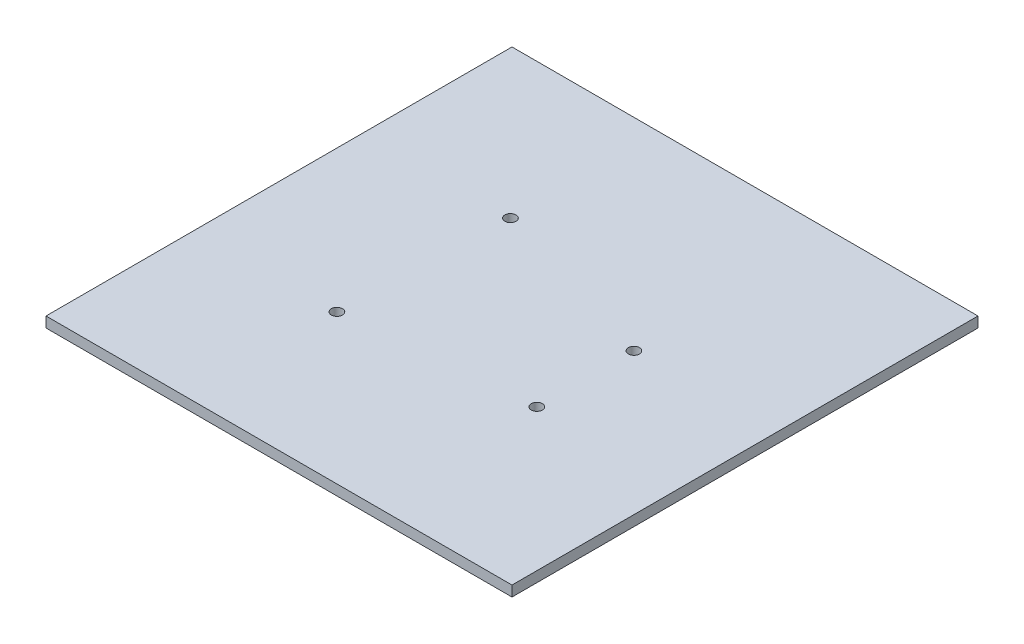
ISO-10303-21;
HEADER;
FILE_DESCRIPTION(('STEP AP214'),'2;1');
FILE_NAME('part.step','',(''),(''),'','','');
FILE_SCHEMA(('AUTOMOTIVE_DESIGN { 1 0 10303 214 1 1 1 1 }'));
ENDSEC;
DATA;
#1=APPLICATION_CONTEXT('core data for automotive mechanical design processes');
#2=APPLICATION_PROTOCOL_DEFINITION('international standard','automotive_design',2000,#1);
#3=PRODUCT_CONTEXT('',#1,'mechanical');
#4=PRODUCT('Part','Part','',(#3));
#5=PRODUCT_RELATED_PRODUCT_CATEGORY('part','',(#4));
#6=PRODUCT_DEFINITION_FORMATION('','',#4);
#7=PRODUCT_DEFINITION_CONTEXT('part definition',#1,'design');
#8=PRODUCT_DEFINITION('design','',#6,#7);
#9=PRODUCT_DEFINITION_SHAPE('','',#8);
#10=(LENGTH_UNIT() NAMED_UNIT(*) SI_UNIT(.MILLI.,.METRE.));
#11=(NAMED_UNIT(*) PLANE_ANGLE_UNIT() SI_UNIT($,.RADIAN.));
#12=(NAMED_UNIT(*) SI_UNIT($,.STERADIAN.) SOLID_ANGLE_UNIT());
#13=UNCERTAINTY_MEASURE_WITH_UNIT(LENGTH_MEASURE(1.E-05),#10,'distance_accuracy_value','');
#14=(GEOMETRIC_REPRESENTATION_CONTEXT(3) GLOBAL_UNCERTAINTY_ASSIGNED_CONTEXT((#13)) GLOBAL_UNIT_ASSIGNED_CONTEXT((#10,
#11,#12)) REPRESENTATION_CONTEXT('',''));
#15=CARTESIAN_POINT('',(0.,0.,0.));
#16=DIRECTION('',(0.,0.,1.));
#17=DIRECTION('',(1.,0.,0.));
#18=AXIS2_PLACEMENT_3D('',#15,#16,#17);
#19=CARTESIAN_POINT('',(-67.,3.,0.));
#20=DIRECTION('',(1.,0.,0.));
#21=DIRECTION('',(0.,0.,-1.));
#22=AXIS2_PLACEMENT_3D('',#19,#20,#21);
#23=PLANE('',#22);
#24=DIRECTION('',(0.,0.,1.));
#25=VECTOR('',#24,1.);
#26=CARTESIAN_POINT('',(-67.,0.,0.));
#27=LINE('',#26,#25);
#28=CARTESIAN_POINT('',(-67.,0.,-67.));
#29=VERTEX_POINT('',#28);
#30=CARTESIAN_POINT('',(-67.,0.,67.));
#31=VERTEX_POINT('',#30);
#32=EDGE_CURVE('E115',#29,#31,#27,.T.);
#33=ORIENTED_EDGE('',*,*,#32,.T.);
#34=DIRECTION('',(0.,-1.,0.));
#35=VECTOR('',#34,1.);
#36=CARTESIAN_POINT('',(-67.,3.,67.));
#37=LINE('',#36,#35);
#38=CARTESIAN_POINT('',(-67.,3.,67.));
#39=VERTEX_POINT('',#38);
#40=EDGE_CURVE('E11',#39,#31,#37,.T.);
#41=ORIENTED_EDGE('',*,*,#40,.F.);
#42=DIRECTION('',(0.,0.,1.));
#43=VECTOR('',#42,1.);
#44=CARTESIAN_POINT('',(-67.,3.,0.));
#45=LINE('',#44,#43);
#46=CARTESIAN_POINT('',(-67.,3.,-67.));
#47=VERTEX_POINT('',#46);
#48=EDGE_CURVE('E89',#47,#39,#45,.T.);
#49=ORIENTED_EDGE('',*,*,#48,.F.);
#50=DIRECTION('',(0.,-1.,0.));
#51=VECTOR('',#50,1.);
#52=CARTESIAN_POINT('',(-67.,3.,-67.));
#53=LINE('',#52,#51);
#54=EDGE_CURVE('E55',#47,#29,#53,.T.);
#55=ORIENTED_EDGE('',*,*,#54,.T.);
#56=EDGE_LOOP('',(#33,#41,#49,#55));
#57=FACE_BOUND('',#56,.T.);
#58=ADVANCED_FACE('F38',(#57),#23,.F.);
#59=CARTESIAN_POINT('',(0.,3.,67.));
#60=DIRECTION('',(0.,0.,-1.));
#61=DIRECTION('',(-1.,0.,0.));
#62=AXIS2_PLACEMENT_3D('',#59,#60,#61);
#63=PLANE('',#62);
#64=DIRECTION('',(1.,0.,0.));
#65=VECTOR('',#64,1.);
#66=CARTESIAN_POINT('',(0.,0.,67.));
#67=LINE('',#66,#65);
#68=CARTESIAN_POINT('',(67.,0.,67.));
#69=VERTEX_POINT('',#68);
#70=EDGE_CURVE('E94',#31,#69,#67,.T.);
#71=ORIENTED_EDGE('',*,*,#70,.T.);
#72=DIRECTION('',(0.,-1.,0.));
#73=VECTOR('',#72,1.);
#74=CARTESIAN_POINT('',(67.,3.,67.));
#75=LINE('',#74,#73);
#76=CARTESIAN_POINT('',(67.,3.,67.));
#77=VERTEX_POINT('',#76);
#78=EDGE_CURVE('E47',#77,#69,#75,.T.);
#79=ORIENTED_EDGE('',*,*,#78,.F.);
#80=DIRECTION('',(1.,0.,0.));
#81=VECTOR('',#80,1.);
#82=CARTESIAN_POINT('',(0.,3.,67.));
#83=LINE('',#82,#81);
#84=EDGE_CURVE('E80',#39,#77,#83,.T.);
#85=ORIENTED_EDGE('',*,*,#84,.F.);
#86=ORIENTED_EDGE('',*,*,#40,.T.);
#87=EDGE_LOOP('',(#71,#79,#85,#86));
#88=FACE_BOUND('',#87,.T.);
#89=ADVANCED_FACE('F93',(#88),#63,.F.);
#90=CARTESIAN_POINT('',(67.,3.,0.));
#91=DIRECTION('',(1.,0.,0.));
#92=DIRECTION('',(0.,0.,-1.));
#93=AXIS2_PLACEMENT_3D('',#90,#91,#92);
#94=PLANE('',#93);
#95=DIRECTION('',(0.,0.,1.));
#96=VECTOR('',#95,1.);
#97=CARTESIAN_POINT('',(67.,0.,0.));
#98=LINE('',#97,#96);
#99=CARTESIAN_POINT('',(67.,0.,-67.));
#100=VERTEX_POINT('',#99);
#101=EDGE_CURVE('E118',#100,#69,#98,.T.);
#102=ORIENTED_EDGE('',*,*,#101,.F.);
#103=DIRECTION('',(0.,-1.,0.));
#104=VECTOR('',#103,1.);
#105=CARTESIAN_POINT('',(67.,3.,-67.));
#106=LINE('',#105,#104);
#107=CARTESIAN_POINT('',(67.,3.,-67.));
#108=VERTEX_POINT('',#107);
#109=EDGE_CURVE('E69',#108,#100,#106,.T.);
#110=ORIENTED_EDGE('',*,*,#109,.F.);
#111=DIRECTION('',(0.,0.,1.));
#112=VECTOR('',#111,1.);
#113=CARTESIAN_POINT('',(67.,3.,0.));
#114=LINE('',#113,#112);
#115=EDGE_CURVE('E88',#108,#77,#114,.T.);
#116=ORIENTED_EDGE('',*,*,#115,.T.);
#117=ORIENTED_EDGE('',*,*,#78,.T.);
#118=EDGE_LOOP('',(#102,#110,#116,#117));
#119=FACE_BOUND('',#118,.T.);
#120=ADVANCED_FACE('F97',(#119),#94,.T.);
#121=CARTESIAN_POINT('',(26.2,3.,19.05));
#122=DIRECTION('',(0.,-1.,0.));
#123=DIRECTION('',(0.,0.,-1.));
#124=AXIS2_PLACEMENT_3D('',#121,#122,#123);
#125=CYLINDRICAL_SURFACE('',#124,1.6);
#126=CARTESIAN_POINT('',(26.2,3.,19.05));
#127=DIRECTION('',(0.,1.,0.));
#128=DIRECTION('',(0.,0.,1.));
#129=AXIS2_PLACEMENT_3D('',#126,#127,#128);
#130=CIRCLE('',#129,1.6);
#131=CARTESIAN_POINT('',(26.2,3.,20.65));
#132=VERTEX_POINT('',#131);
#133=EDGE_CURVE('E106',#132,#132,#130,.T.);
#134=ORIENTED_EDGE('',*,*,#133,.T.);
#135=EDGE_LOOP('',(#134));
#136=FACE_BOUND('',#135,.T.);
#137=CARTESIAN_POINT('',(26.2,0.,19.05));
#138=DIRECTION('',(0.,1.,0.));
#139=DIRECTION('',(0.,0.,1.));
#140=AXIS2_PLACEMENT_3D('',#137,#138,#139);
#141=CIRCLE('',#140,1.6);
#142=CARTESIAN_POINT('',(26.2,0.,20.65));
#143=VERTEX_POINT('',#142);
#144=EDGE_CURVE('E126',#143,#143,#141,.T.);
#145=ORIENTED_EDGE('',*,*,#144,.F.);
#146=EDGE_LOOP('',(#145));
#147=FACE_BOUND('',#146,.T.);
#148=ADVANCED_FACE('F162',(#136,#147),#125,.F.);
#149=CARTESIAN_POINT('',(-26.2,3.,24.15));
#150=DIRECTION('',(0.,-1.,0.));
#151=DIRECTION('',(0.,0.,-1.));
#152=AXIS2_PLACEMENT_3D('',#149,#150,#151);
#153=CYLINDRICAL_SURFACE('',#152,1.6);
#154=CARTESIAN_POINT('',(-26.2,3.,24.15));
#155=DIRECTION('',(0.,1.,0.));
#156=DIRECTION('',(0.,0.,1.));
#157=AXIS2_PLACEMENT_3D('',#154,#155,#156);
#158=CIRCLE('',#157,1.6);
#159=CARTESIAN_POINT('',(-26.2,3.,25.75));
#160=VERTEX_POINT('',#159);
#161=EDGE_CURVE('E100',#160,#160,#158,.T.);
#162=ORIENTED_EDGE('',*,*,#161,.T.);
#163=EDGE_LOOP('',(#162));
#164=FACE_BOUND('',#163,.T.);
#165=CARTESIAN_POINT('',(-26.2,0.,24.15));
#166=DIRECTION('',(0.,1.,0.));
#167=DIRECTION('',(0.,0.,1.));
#168=AXIS2_PLACEMENT_3D('',#165,#166,#167);
#169=CIRCLE('',#168,1.6);
#170=CARTESIAN_POINT('',(-26.2,0.,25.75));
#171=VERTEX_POINT('',#170);
#172=EDGE_CURVE('E123',#171,#171,#169,.T.);
#173=ORIENTED_EDGE('',*,*,#172,.F.);
#174=EDGE_LOOP('',(#173));
#175=FACE_BOUND('',#174,.T.);
#176=ADVANCED_FACE('F166',(#164,#175),#153,.F.);
#177=CARTESIAN_POINT('',(0.,3.,-67.));
#178=DIRECTION('',(0.,0.,-1.));
#179=DIRECTION('',(-1.,0.,0.));
#180=AXIS2_PLACEMENT_3D('',#177,#178,#179);
#181=PLANE('',#180);
#182=DIRECTION('',(1.,0.,0.));
#183=VECTOR('',#182,1.);
#184=CARTESIAN_POINT('',(0.,0.,-67.));
#185=LINE('',#184,#183);
#186=EDGE_CURVE('E120',#29,#100,#185,.T.);
#187=ORIENTED_EDGE('',*,*,#186,.F.);
#188=ORIENTED_EDGE('',*,*,#54,.F.);
#189=DIRECTION('',(1.,0.,0.));
#190=VECTOR('',#189,1.);
#191=CARTESIAN_POINT('',(0.,3.,-67.));
#192=LINE('',#191,#190);
#193=EDGE_CURVE('E98',#47,#108,#192,.T.);
#194=ORIENTED_EDGE('',*,*,#193,.T.);
#195=ORIENTED_EDGE('',*,*,#109,.T.);
#196=EDGE_LOOP('',(#187,#188,#194,#195));
#197=FACE_BOUND('',#196,.T.);
#198=ADVANCED_FACE('F163',(#197),#181,.T.);
#199=CARTESIAN_POINT('',(-24.6,3.,-24.15));
#200=DIRECTION('',(0.,-1.,0.));
#201=DIRECTION('',(0.,0.,-1.));
#202=AXIS2_PLACEMENT_3D('',#199,#200,#201);
#203=CYLINDRICAL_SURFACE('',#202,1.6);
#204=CARTESIAN_POINT('',(-24.6,3.,-24.15));
#205=DIRECTION('',(0.,1.,0.));
#206=DIRECTION('',(0.,0.,1.));
#207=AXIS2_PLACEMENT_3D('',#204,#205,#206);
#208=CIRCLE('',#207,1.6);
#209=CARTESIAN_POINT('',(-24.6,3.,-22.55));
#210=VERTEX_POINT('',#209);
#211=EDGE_CURVE('E132',#210,#210,#208,.T.);
#212=ORIENTED_EDGE('',*,*,#211,.T.);
#213=EDGE_LOOP('',(#212));
#214=FACE_BOUND('',#213,.T.);
#215=CARTESIAN_POINT('',(-24.6,0.,-24.15));
#216=DIRECTION('',(0.,1.,0.));
#217=DIRECTION('',(0.,0.,1.));
#218=AXIS2_PLACEMENT_3D('',#215,#216,#217);
#219=CIRCLE('',#218,1.6);
#220=CARTESIAN_POINT('',(-24.6,0.,-22.55));
#221=VERTEX_POINT('',#220);
#222=EDGE_CURVE('E112',#221,#221,#219,.T.);
#223=ORIENTED_EDGE('',*,*,#222,.F.);
#224=EDGE_LOOP('',(#223));
#225=FACE_BOUND('',#224,.T.);
#226=ADVANCED_FACE('F40',(#214,#225),#203,.F.);
#227=CARTESIAN_POINT('',(26.2,3.,-8.85));
#228=DIRECTION('',(0.,-1.,0.));
#229=DIRECTION('',(0.,0.,-1.));
#230=AXIS2_PLACEMENT_3D('',#227,#228,#229);
#231=CYLINDRICAL_SURFACE('',#230,1.6);
#232=CARTESIAN_POINT('',(26.2,3.,-8.85));
#233=DIRECTION('',(0.,1.,0.));
#234=DIRECTION('',(0.,0.,1.));
#235=AXIS2_PLACEMENT_3D('',#232,#233,#234);
#236=CIRCLE('',#235,1.6);
#237=CARTESIAN_POINT('',(26.2,3.,-7.25));
#238=VERTEX_POINT('',#237);
#239=EDGE_CURVE('E109',#238,#238,#236,.T.);
#240=ORIENTED_EDGE('',*,*,#239,.T.);
#241=EDGE_LOOP('',(#240));
#242=FACE_BOUND('',#241,.T.);
#243=CARTESIAN_POINT('',(26.2,0.,-8.85));
#244=DIRECTION('',(0.,1.,0.));
#245=DIRECTION('',(0.,0.,1.));
#246=AXIS2_PLACEMENT_3D('',#243,#244,#245);
#247=CIRCLE('',#246,1.6);
#248=CARTESIAN_POINT('',(26.2,0.,-7.25));
#249=VERTEX_POINT('',#248);
#250=EDGE_CURVE('E129',#249,#249,#247,.T.);
#251=ORIENTED_EDGE('',*,*,#250,.F.);
#252=EDGE_LOOP('',(#251));
#253=FACE_BOUND('',#252,.T.);
#254=ADVANCED_FACE('F144',(#242,#253),#231,.F.);
#255=CARTESIAN_POINT('',(0.,3.,0.));
#256=DIRECTION('',(0.,1.,0.));
#257=DIRECTION('',(0.,0.,1.));
#258=AXIS2_PLACEMENT_3D('',#255,#256,#257);
#259=PLANE('',#258);
#260=ORIENTED_EDGE('',*,*,#211,.F.);
#261=EDGE_LOOP('',(#260));
#262=FACE_BOUND('',#261,.T.);
#263=ORIENTED_EDGE('',*,*,#48,.T.);
#264=ORIENTED_EDGE('',*,*,#84,.T.);
#265=ORIENTED_EDGE('',*,*,#115,.F.);
#266=ORIENTED_EDGE('',*,*,#193,.F.);
#267=EDGE_LOOP('',(#263,#264,#265,#266));
#268=FACE_BOUND('',#267,.T.);
#269=ORIENTED_EDGE('',*,*,#161,.F.);
#270=EDGE_LOOP('',(#269));
#271=FACE_BOUND('',#270,.T.);
#272=ORIENTED_EDGE('',*,*,#133,.F.);
#273=EDGE_LOOP('',(#272));
#274=FACE_BOUND('',#273,.T.);
#275=ORIENTED_EDGE('',*,*,#239,.F.);
#276=EDGE_LOOP('',(#275));
#277=FACE_BOUND('',#276,.T.);
#278=ADVANCED_FACE('F84',(#262,#268,#271,#274,#277),#259,.T.);
#279=CARTESIAN_POINT('',(0.,0.,0.));
#280=DIRECTION('',(0.,1.,0.));
#281=DIRECTION('',(0.,0.,1.));
#282=AXIS2_PLACEMENT_3D('',#279,#280,#281);
#283=PLANE('',#282);
#284=ORIENTED_EDGE('',*,*,#222,.T.);
#285=EDGE_LOOP('',(#284));
#286=FACE_BOUND('',#285,.T.);
#287=ORIENTED_EDGE('',*,*,#32,.F.);
#288=ORIENTED_EDGE('',*,*,#186,.T.);
#289=ORIENTED_EDGE('',*,*,#101,.T.);
#290=ORIENTED_EDGE('',*,*,#70,.F.);
#291=EDGE_LOOP('',(#287,#288,#289,#290));
#292=FACE_BOUND('',#291,.T.);
#293=ORIENTED_EDGE('',*,*,#172,.T.);
#294=EDGE_LOOP('',(#293));
#295=FACE_BOUND('',#294,.T.);
#296=ORIENTED_EDGE('',*,*,#144,.T.);
#297=EDGE_LOOP('',(#296));
#298=FACE_BOUND('',#297,.T.);
#299=ORIENTED_EDGE('',*,*,#250,.T.);
#300=EDGE_LOOP('',(#299));
#301=FACE_BOUND('',#300,.T.);
#302=ADVANCED_FACE('F143',(#286,#292,#295,#298,#301),#283,.F.);
#303=CLOSED_SHELL('',(#58,#89,#120,#148,#176,#198,#226,#254,#278,#302));
#304=MANIFOLD_SOLID_BREP('B2',#303);
#305=ADVANCED_BREP_SHAPE_REPRESENTATION('',(#18,#304),#14);
#306=SHAPE_DEFINITION_REPRESENTATION(#9,#305);
ENDSEC;
END-ISO-10303-21;
